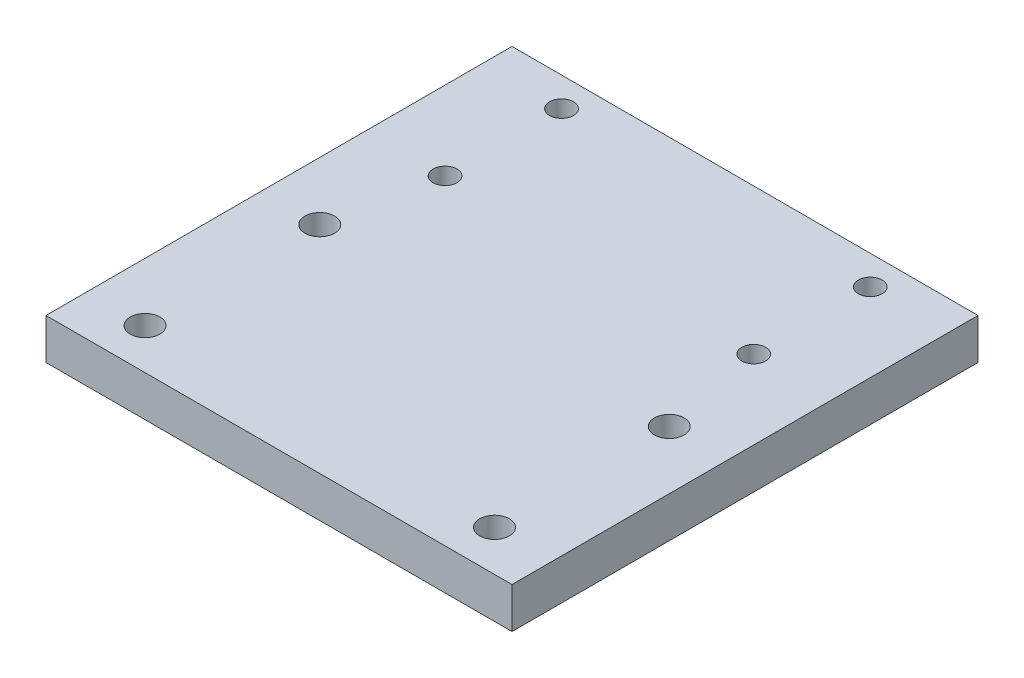
ISO-10303-21;
HEADER;
FILE_DESCRIPTION(('STEP AP214'),'2;1');
FILE_NAME('part.step','',(''),(''),'','','');
FILE_SCHEMA(('AUTOMOTIVE_DESIGN { 1 0 10303 214 1 1 1 1 }'));
ENDSEC;
DATA;
#1=APPLICATION_CONTEXT('core data for automotive mechanical design processes');
#2=APPLICATION_PROTOCOL_DEFINITION('international standard','automotive_design',2000,#1);
#3=PRODUCT_CONTEXT('',#1,'mechanical');
#4=PRODUCT('Part','Part','',(#3));
#5=PRODUCT_RELATED_PRODUCT_CATEGORY('part','',(#4));
#6=PRODUCT_DEFINITION_FORMATION('','',#4);
#7=PRODUCT_DEFINITION_CONTEXT('part definition',#1,'design');
#8=PRODUCT_DEFINITION('design','',#6,#7);
#9=PRODUCT_DEFINITION_SHAPE('','',#8);
#10=(LENGTH_UNIT() NAMED_UNIT(*) SI_UNIT(.MILLI.,.METRE.));
#11=(NAMED_UNIT(*) PLANE_ANGLE_UNIT() SI_UNIT($,.RADIAN.));
#12=(NAMED_UNIT(*) SI_UNIT($,.STERADIAN.) SOLID_ANGLE_UNIT());
#13=UNCERTAINTY_MEASURE_WITH_UNIT(LENGTH_MEASURE(1.E-05),#10,'distance_accuracy_value','');
#14=(GEOMETRIC_REPRESENTATION_CONTEXT(3) GLOBAL_UNCERTAINTY_ASSIGNED_CONTEXT((#13)) GLOBAL_UNIT_ASSIGNED_CONTEXT((#10,
#11,#12)) REPRESENTATION_CONTEXT('',''));
#15=CARTESIAN_POINT('',(0.,0.,0.));
#16=DIRECTION('',(0.,0.,1.));
#17=DIRECTION('',(1.,0.,0.));
#18=AXIS2_PLACEMENT_3D('',#15,#16,#17);
#19=CARTESIAN_POINT('',(0.,0.,0.));
#20=DIRECTION('',(0.,1.,0.));
#21=DIRECTION('',(0.,0.,1.));
#22=AXIS2_PLACEMENT_3D('',#19,#20,#21);
#23=PLANE('',#22);
#24=CARTESIAN_POINT('',(-26.5,0.,-33.));
#25=DIRECTION('',(0.,-1.,0.));
#26=DIRECTION('',(0.,0.,-1.));
#27=AXIS2_PLACEMENT_3D('',#24,#25,#26);
#28=CIRCLE('',#27,2.9765625);
#29=CARTESIAN_POINT('',(-26.5,0.,-35.9765625));
#30=VERTEX_POINT('',#29);
#31=EDGE_CURVE('E360',#30,#30,#28,.T.);
#32=ORIENTED_EDGE('',*,*,#31,.F.);
#33=EDGE_LOOP('',(#32));
#34=FACE_BOUND('',#33,.T.);
#35=CARTESIAN_POINT('',(26.5,0.,-33.));
#36=DIRECTION('',(0.,-1.,0.));
#37=DIRECTION('',(0.,0.,-1.));
#38=AXIS2_PLACEMENT_3D('',#35,#36,#37);
#39=CIRCLE('',#38,2.9765625);
#40=CARTESIAN_POINT('',(26.5,0.,-35.9765625));
#41=VERTEX_POINT('',#40);
#42=EDGE_CURVE('E127',#41,#41,#39,.T.);
#43=ORIENTED_EDGE('',*,*,#42,.F.);
#44=EDGE_LOOP('',(#43));
#45=FACE_BOUND('',#44,.T.);
#46=CARTESIAN_POINT('',(-26.5,0.,-53.));
#47=DIRECTION('',(0.,-1.,0.));
#48=DIRECTION('',(0.,0.,-1.));
#49=AXIS2_PLACEMENT_3D('',#46,#47,#48);
#50=CIRCLE('',#49,2.9765625);
#51=CARTESIAN_POINT('',(-26.5,0.,-55.9765625));
#52=VERTEX_POINT('',#51);
#53=EDGE_CURVE('E120',#52,#52,#50,.T.);
#54=ORIENTED_EDGE('',*,*,#53,.F.);
#55=EDGE_LOOP('',(#54));
#56=FACE_BOUND('',#55,.T.);
#57=CARTESIAN_POINT('',(-30.,0.,15.));
#58=DIRECTION('',(0.,1.,0.));
#59=DIRECTION('',(0.,0.,-1.));
#60=AXIS2_PLACEMENT_3D('',#57,#58,#59);
#61=CIRCLE('',#60,2.55);
#62=CARTESIAN_POINT('',(-30.,0.,12.45));
#63=VERTEX_POINT('',#62);
#64=EDGE_CURVE('E152',#63,#63,#61,.T.);
#65=ORIENTED_EDGE('',*,*,#64,.T.);
#66=EDGE_LOOP('',(#65));
#67=FACE_BOUND('',#66,.T.);
#68=CARTESIAN_POINT('',(30.,0.,15.));
#69=DIRECTION('',(0.,1.,0.));
#70=DIRECTION('',(0.,0.,1.));
#71=AXIS2_PLACEMENT_3D('',#68,#69,#70);
#72=CIRCLE('',#71,2.55);
#73=CARTESIAN_POINT('',(30.,0.,17.55));
#74=VERTEX_POINT('',#73);
#75=EDGE_CURVE('E156',#74,#74,#72,.T.);
#76=ORIENTED_EDGE('',*,*,#75,.T.);
#77=EDGE_LOOP('',(#76));
#78=FACE_BOUND('',#77,.T.);
#79=CARTESIAN_POINT('',(30.,0.,-15.));
#80=DIRECTION('',(0.,1.,0.));
#81=DIRECTION('',(0.,0.,-1.));
#82=AXIS2_PLACEMENT_3D('',#79,#80,#81);
#83=CIRCLE('',#82,2.55);
#84=CARTESIAN_POINT('',(30.,0.,-17.55));
#85=VERTEX_POINT('',#84);
#86=EDGE_CURVE('E162',#85,#85,#83,.T.);
#87=ORIENTED_EDGE('',*,*,#86,.T.);
#88=EDGE_LOOP('',(#87));
#89=FACE_BOUND('',#88,.T.);
#90=CARTESIAN_POINT('',(-30.,0.,-15.));
#91=DIRECTION('',(0.,1.,0.));
#92=DIRECTION('',(0.,0.,1.));
#93=AXIS2_PLACEMENT_3D('',#90,#91,#92);
#94=CIRCLE('',#93,2.55);
#95=CARTESIAN_POINT('',(-30.,0.,-12.45));
#96=VERTEX_POINT('',#95);
#97=EDGE_CURVE('E168',#96,#96,#94,.T.);
#98=ORIENTED_EDGE('',*,*,#97,.T.);
#99=EDGE_LOOP('',(#98));
#100=FACE_BOUND('',#99,.T.);
#101=DIRECTION('',(0.,0.,1.));
#102=VECTOR('',#101,1.);
#103=CARTESIAN_POINT('',(-40.,0.,-58.));
#104=LINE('',#103,#102);
#105=CARTESIAN_POINT('',(-40.,0.,-58.));
#106=VERTEX_POINT('',#105);
#107=CARTESIAN_POINT('',(-40.,0.,22.));
#108=VERTEX_POINT('',#107);
#109=EDGE_CURVE('E100',#106,#108,#104,.T.);
#110=ORIENTED_EDGE('',*,*,#109,.F.);
#111=DIRECTION('',(-1.,0.,0.));
#112=VECTOR('',#111,1.);
#113=CARTESIAN_POINT('',(-40.,0.,-58.));
#114=LINE('',#113,#112);
#115=CARTESIAN_POINT('',(40.,0.,-58.));
#116=VERTEX_POINT('',#115);
#117=EDGE_CURVE('E74',#116,#106,#114,.T.);
#118=ORIENTED_EDGE('',*,*,#117,.F.);
#119=DIRECTION('',(0.,0.,-1.));
#120=VECTOR('',#119,1.);
#121=CARTESIAN_POINT('',(40.,0.,-58.));
#122=LINE('',#121,#120);
#123=CARTESIAN_POINT('',(40.,0.,22.));
#124=VERTEX_POINT('',#123);
#125=EDGE_CURVE('E68',#124,#116,#122,.T.);
#126=ORIENTED_EDGE('',*,*,#125,.F.);
#127=DIRECTION('',(1.,0.,0.));
#128=VECTOR('',#127,1.);
#129=CARTESIAN_POINT('',(-40.,0.,22.));
#130=LINE('',#129,#128);
#131=EDGE_CURVE('E91',#108,#124,#130,.T.);
#132=ORIENTED_EDGE('',*,*,#131,.F.);
#133=EDGE_LOOP('',(#110,#118,#126,#132));
#134=FACE_BOUND('',#133,.T.);
#135=CARTESIAN_POINT('',(26.5,0.,-53.));
#136=DIRECTION('',(0.,-1.,0.));
#137=DIRECTION('',(0.,0.,-1.));
#138=AXIS2_PLACEMENT_3D('',#135,#136,#137);
#139=CIRCLE('',#138,2.9765625);
#140=CARTESIAN_POINT('',(26.5,0.,-55.9765625));
#141=VERTEX_POINT('',#140);
#142=EDGE_CURVE('E116',#141,#141,#139,.T.);
#143=ORIENTED_EDGE('',*,*,#142,.F.);
#144=EDGE_LOOP('',(#143));
#145=FACE_BOUND('',#144,.T.);
#146=ADVANCED_FACE('F32',(#34,#45,#56,#67,#78,#89,#100,#134,#145),#23,.F.);
#147=CARTESIAN_POINT('',(0.,7.,0.));
#148=DIRECTION('',(0.,1.,0.));
#149=DIRECTION('',(0.,0.,1.));
#150=AXIS2_PLACEMENT_3D('',#147,#148,#149);
#151=PLANE('',#150);
#152=CARTESIAN_POINT('',(26.5,7.,-33.));
#153=DIRECTION('',(0.,1.,0.));
#154=DIRECTION('',(0.,0.,1.));
#155=AXIS2_PLACEMENT_3D('',#152,#153,#154);
#156=CIRCLE('',#155,2.05);
#157=CARTESIAN_POINT('',(26.5,7.,-30.95));
#158=VERTEX_POINT('',#157);
#159=EDGE_CURVE('E143',#158,#158,#156,.T.);
#160=ORIENTED_EDGE('',*,*,#159,.F.);
#161=EDGE_LOOP('',(#160));
#162=FACE_BOUND('',#161,.T.);
#163=CARTESIAN_POINT('',(-26.5,7.,-53.));
#164=DIRECTION('',(0.,1.,0.));
#165=DIRECTION('',(0.,0.,1.));
#166=AXIS2_PLACEMENT_3D('',#163,#164,#165);
#167=CIRCLE('',#166,2.05);
#168=CARTESIAN_POINT('',(-26.5,7.,-50.95));
#169=VERTEX_POINT('',#168);
#170=EDGE_CURVE('E149',#169,#169,#167,.T.);
#171=ORIENTED_EDGE('',*,*,#170,.F.);
#172=EDGE_LOOP('',(#171));
#173=FACE_BOUND('',#172,.T.);
#174=CARTESIAN_POINT('',(30.,7.,15.));
#175=DIRECTION('',(0.,1.,0.));
#176=DIRECTION('',(0.,0.,1.));
#177=AXIS2_PLACEMENT_3D('',#174,#175,#176);
#178=CIRCLE('',#177,2.55);
#179=CARTESIAN_POINT('',(30.,7.,17.55));
#180=VERTEX_POINT('',#179);
#181=EDGE_CURVE('E159',#180,#180,#178,.T.);
#182=ORIENTED_EDGE('',*,*,#181,.F.);
#183=EDGE_LOOP('',(#182));
#184=FACE_BOUND('',#183,.T.);
#185=CARTESIAN_POINT('',(-30.,7.,-15.));
#186=DIRECTION('',(0.,1.,0.));
#187=DIRECTION('',(0.,0.,1.));
#188=AXIS2_PLACEMENT_3D('',#185,#186,#187);
#189=CIRCLE('',#188,2.55);
#190=CARTESIAN_POINT('',(-30.,7.,-12.45));
#191=VERTEX_POINT('',#190);
#192=EDGE_CURVE('E103',#191,#191,#189,.T.);
#193=ORIENTED_EDGE('',*,*,#192,.F.);
#194=EDGE_LOOP('',(#193));
#195=FACE_BOUND('',#194,.T.);
#196=DIRECTION('',(0.,0.,1.));
#197=VECTOR('',#196,1.);
#198=CARTESIAN_POINT('',(-40.,7.,-58.));
#199=LINE('',#198,#197);
#200=CARTESIAN_POINT('',(-40.,7.,-58.));
#201=VERTEX_POINT('',#200);
#202=CARTESIAN_POINT('',(-40.,7.,22.));
#203=VERTEX_POINT('',#202);
#204=EDGE_CURVE('E87',#201,#203,#199,.T.);
#205=ORIENTED_EDGE('',*,*,#204,.T.);
#206=DIRECTION('',(1.,0.,0.));
#207=VECTOR('',#206,1.);
#208=CARTESIAN_POINT('',(-40.,7.,22.));
#209=LINE('',#208,#207);
#210=CARTESIAN_POINT('',(40.,7.,22.));
#211=VERTEX_POINT('',#210);
#212=EDGE_CURVE('E81',#203,#211,#209,.T.);
#213=ORIENTED_EDGE('',*,*,#212,.T.);
#214=DIRECTION('',(0.,0.,-1.));
#215=VECTOR('',#214,1.);
#216=CARTESIAN_POINT('',(40.,7.,-58.));
#217=LINE('',#216,#215);
#218=CARTESIAN_POINT('',(40.,7.,-58.));
#219=VERTEX_POINT('',#218);
#220=EDGE_CURVE('E85',#211,#219,#217,.T.);
#221=ORIENTED_EDGE('',*,*,#220,.T.);
#222=DIRECTION('',(-1.,0.,0.));
#223=VECTOR('',#222,1.);
#224=CARTESIAN_POINT('',(-40.,7.,-58.));
#225=LINE('',#224,#223);
#226=EDGE_CURVE('E51',#219,#201,#225,.T.);
#227=ORIENTED_EDGE('',*,*,#226,.T.);
#228=EDGE_LOOP('',(#205,#213,#221,#227));
#229=FACE_BOUND('',#228,.T.);
#230=CARTESIAN_POINT('',(30.,7.,-15.));
#231=DIRECTION('',(0.,1.,0.));
#232=DIRECTION('',(0.,0.,-1.));
#233=AXIS2_PLACEMENT_3D('',#230,#231,#232);
#234=CIRCLE('',#233,2.55);
#235=CARTESIAN_POINT('',(30.,7.,-17.55));
#236=VERTEX_POINT('',#235);
#237=EDGE_CURVE('E165',#236,#236,#234,.T.);
#238=ORIENTED_EDGE('',*,*,#237,.F.);
#239=EDGE_LOOP('',(#238));
#240=FACE_BOUND('',#239,.T.);
#241=CARTESIAN_POINT('',(-30.,7.,15.));
#242=DIRECTION('',(0.,1.,0.));
#243=DIRECTION('',(0.,0.,-1.));
#244=AXIS2_PLACEMENT_3D('',#241,#242,#243);
#245=CIRCLE('',#244,2.55);
#246=CARTESIAN_POINT('',(-30.,7.,12.45));
#247=VERTEX_POINT('',#246);
#248=EDGE_CURVE('E153',#247,#247,#245,.T.);
#249=ORIENTED_EDGE('',*,*,#248,.F.);
#250=EDGE_LOOP('',(#249));
#251=FACE_BOUND('',#250,.T.);
#252=CARTESIAN_POINT('',(26.5,7.,-53.));
#253=DIRECTION('',(0.,1.,0.));
#254=DIRECTION('',(0.,0.,-1.));
#255=AXIS2_PLACEMENT_3D('',#252,#253,#254);
#256=CIRCLE('',#255,2.05);
#257=CARTESIAN_POINT('',(26.5,7.,-55.05));
#258=VERTEX_POINT('',#257);
#259=EDGE_CURVE('E146',#258,#258,#256,.T.);
#260=ORIENTED_EDGE('',*,*,#259,.F.);
#261=EDGE_LOOP('',(#260));
#262=FACE_BOUND('',#261,.T.);
#263=CARTESIAN_POINT('',(-26.5,7.,-33.));
#264=DIRECTION('',(0.,1.,0.));
#265=DIRECTION('',(0.,0.,-1.));
#266=AXIS2_PLACEMENT_3D('',#263,#264,#265);
#267=CIRCLE('',#266,2.05);
#268=CARTESIAN_POINT('',(-26.5,7.,-35.05));
#269=VERTEX_POINT('',#268);
#270=EDGE_CURVE('E112',#269,#269,#267,.T.);
#271=ORIENTED_EDGE('',*,*,#270,.F.);
#272=EDGE_LOOP('',(#271));
#273=FACE_BOUND('',#272,.T.);
#274=ADVANCED_FACE('F82',(#162,#173,#184,#195,#229,#240,#251,#262,#273),#151,.T.);
#275=CARTESIAN_POINT('',(-40.,7.,-58.));
#276=DIRECTION('',(1.,0.,0.));
#277=DIRECTION('',(0.,0.,-1.));
#278=AXIS2_PLACEMENT_3D('',#275,#276,#277);
#279=PLANE('',#278);
#280=ORIENTED_EDGE('',*,*,#109,.T.);
#281=DIRECTION('',(0.,-1.,0.));
#282=VECTOR('',#281,1.);
#283=CARTESIAN_POINT('',(-40.,7.,22.));
#284=LINE('',#283,#282);
#285=EDGE_CURVE('E11',#203,#108,#284,.T.);
#286=ORIENTED_EDGE('',*,*,#285,.F.);
#287=ORIENTED_EDGE('',*,*,#204,.F.);
#288=DIRECTION('',(0.,-1.,0.));
#289=VECTOR('',#288,1.);
#290=CARTESIAN_POINT('',(-40.,7.,-58.));
#291=LINE('',#290,#289);
#292=EDGE_CURVE('E96',#201,#106,#291,.T.);
#293=ORIENTED_EDGE('',*,*,#292,.T.);
#294=EDGE_LOOP('',(#280,#286,#287,#293));
#295=FACE_BOUND('',#294,.T.);
#296=ADVANCED_FACE('F34',(#295),#279,.F.);
#297=CARTESIAN_POINT('',(-40.,7.,22.));
#298=DIRECTION('',(0.,0.,-1.));
#299=DIRECTION('',(-1.,0.,0.));
#300=AXIS2_PLACEMENT_3D('',#297,#298,#299);
#301=PLANE('',#300);
#302=ORIENTED_EDGE('',*,*,#131,.T.);
#303=DIRECTION('',(0.,-1.,0.));
#304=VECTOR('',#303,1.);
#305=CARTESIAN_POINT('',(40.,7.,22.));
#306=LINE('',#305,#304);
#307=EDGE_CURVE('E42',#211,#124,#306,.T.);
#308=ORIENTED_EDGE('',*,*,#307,.F.);
#309=ORIENTED_EDGE('',*,*,#212,.F.);
#310=ORIENTED_EDGE('',*,*,#285,.T.);
#311=EDGE_LOOP('',(#302,#308,#309,#310));
#312=FACE_BOUND('',#311,.T.);
#313=ADVANCED_FACE('F90',(#312),#301,.F.);
#314=CARTESIAN_POINT('',(40.,7.,-58.));
#315=DIRECTION('',(-1.,0.,0.));
#316=DIRECTION('',(0.,0.,1.));
#317=AXIS2_PLACEMENT_3D('',#314,#315,#316);
#318=PLANE('',#317);
#319=ORIENTED_EDGE('',*,*,#125,.T.);
#320=DIRECTION('',(0.,-1.,0.));
#321=VECTOR('',#320,1.);
#322=CARTESIAN_POINT('',(40.,7.,-58.));
#323=LINE('',#322,#321);
#324=EDGE_CURVE('E92',#219,#116,#323,.T.);
#325=ORIENTED_EDGE('',*,*,#324,.F.);
#326=ORIENTED_EDGE('',*,*,#220,.F.);
#327=ORIENTED_EDGE('',*,*,#307,.T.);
#328=EDGE_LOOP('',(#319,#325,#326,#327));
#329=FACE_BOUND('',#328,.T.);
#330=ADVANCED_FACE('F94',(#329),#318,.F.);
#331=CARTESIAN_POINT('',(-40.,7.,-58.));
#332=DIRECTION('',(0.,0.,1.));
#333=DIRECTION('',(1.,0.,0.));
#334=AXIS2_PLACEMENT_3D('',#331,#332,#333);
#335=PLANE('',#334);
#336=ORIENTED_EDGE('',*,*,#117,.T.);
#337=ORIENTED_EDGE('',*,*,#292,.F.);
#338=ORIENTED_EDGE('',*,*,#226,.F.);
#339=ORIENTED_EDGE('',*,*,#324,.T.);
#340=EDGE_LOOP('',(#336,#337,#338,#339));
#341=FACE_BOUND('',#340,.T.);
#342=ADVANCED_FACE('F181',(#341),#335,.F.);
#343=CARTESIAN_POINT('',(-30.,7.,-15.));
#344=DIRECTION('',(0.,-1.,0.));
#345=DIRECTION('',(0.,0.,-1.));
#346=AXIS2_PLACEMENT_3D('',#343,#344,#345);
#347=CYLINDRICAL_SURFACE('',#346,2.55);
#348=ORIENTED_EDGE('',*,*,#192,.T.);
#349=EDGE_LOOP('',(#348));
#350=FACE_BOUND('',#349,.T.);
#351=ORIENTED_EDGE('',*,*,#97,.F.);
#352=EDGE_LOOP('',(#351));
#353=FACE_BOUND('',#352,.T.);
#354=ADVANCED_FACE('F178',(#350,#353),#347,.F.);
#355=CARTESIAN_POINT('',(30.,7.,-15.));
#356=DIRECTION('',(0.,-1.,0.));
#357=DIRECTION('',(0.,0.,-1.));
#358=AXIS2_PLACEMENT_3D('',#355,#356,#357);
#359=CYLINDRICAL_SURFACE('',#358,2.55);
#360=ORIENTED_EDGE('',*,*,#237,.T.);
#361=EDGE_LOOP('',(#360));
#362=FACE_BOUND('',#361,.T.);
#363=ORIENTED_EDGE('',*,*,#86,.F.);
#364=EDGE_LOOP('',(#363));
#365=FACE_BOUND('',#364,.T.);
#366=ADVANCED_FACE('F180',(#362,#365),#359,.F.);
#367=CARTESIAN_POINT('',(30.,7.,15.));
#368=DIRECTION('',(0.,-1.,0.));
#369=DIRECTION('',(0.,0.,-1.));
#370=AXIS2_PLACEMENT_3D('',#367,#368,#369);
#371=CYLINDRICAL_SURFACE('',#370,2.55);
#372=ORIENTED_EDGE('',*,*,#181,.T.);
#373=EDGE_LOOP('',(#372));
#374=FACE_BOUND('',#373,.T.);
#375=ORIENTED_EDGE('',*,*,#75,.F.);
#376=EDGE_LOOP('',(#375));
#377=FACE_BOUND('',#376,.T.);
#378=ADVANCED_FACE('F188',(#374,#377),#371,.F.);
#379=CARTESIAN_POINT('',(-30.,7.,15.));
#380=DIRECTION('',(0.,-1.,0.));
#381=DIRECTION('',(0.,0.,-1.));
#382=AXIS2_PLACEMENT_3D('',#379,#380,#381);
#383=CYLINDRICAL_SURFACE('',#382,2.55);
#384=ORIENTED_EDGE('',*,*,#248,.T.);
#385=EDGE_LOOP('',(#384));
#386=FACE_BOUND('',#385,.T.);
#387=ORIENTED_EDGE('',*,*,#64,.F.);
#388=EDGE_LOOP('',(#387));
#389=FACE_BOUND('',#388,.T.);
#390=ADVANCED_FACE('F248',(#386,#389),#383,.F.);
#391=CARTESIAN_POINT('',(-26.5,7.,-53.));
#392=DIRECTION('',(0.,-1.,0.));
#393=DIRECTION('',(0.,0.,-1.));
#394=AXIS2_PLACEMENT_3D('',#391,#392,#393);
#395=CYLINDRICAL_SURFACE('',#394,2.05);
#396=CARTESIAN_POINT('',(-26.5,2.175,-53.));
#397=DIRECTION('',(0.,1.,0.));
#398=DIRECTION('',(0.,0.,1.));
#399=AXIS2_PLACEMENT_3D('',#396,#397,#398);
#400=CIRCLE('',#399,2.05);
#401=CARTESIAN_POINT('',(-26.5,2.175,-50.95));
#402=VERTEX_POINT('',#401);
#403=EDGE_CURVE('E114',#402,#402,#400,.T.);
#404=ORIENTED_EDGE('',*,*,#403,.F.);
#405=EDGE_LOOP('',(#404));
#406=FACE_BOUND('',#405,.T.);
#407=ORIENTED_EDGE('',*,*,#170,.T.);
#408=EDGE_LOOP('',(#407));
#409=FACE_BOUND('',#408,.T.);
#410=ADVANCED_FACE('F244',(#406,#409),#395,.F.);
#411=CARTESIAN_POINT('',(26.5,7.,-53.));
#412=DIRECTION('',(0.,-1.,0.));
#413=DIRECTION('',(0.,0.,-1.));
#414=AXIS2_PLACEMENT_3D('',#411,#412,#413);
#415=CYLINDRICAL_SURFACE('',#414,2.05);
#416=CARTESIAN_POINT('',(26.5,2.175,-53.));
#417=DIRECTION('',(0.,1.,0.));
#418=DIRECTION('',(0.,0.,1.));
#419=AXIS2_PLACEMENT_3D('',#416,#417,#418);
#420=CIRCLE('',#419,2.05);
#421=CARTESIAN_POINT('',(26.5,2.175,-50.95));
#422=VERTEX_POINT('',#421);
#423=EDGE_CURVE('E109',#422,#422,#420,.T.);
#424=ORIENTED_EDGE('',*,*,#423,.F.);
#425=EDGE_LOOP('',(#424));
#426=FACE_BOUND('',#425,.T.);
#427=ORIENTED_EDGE('',*,*,#259,.T.);
#428=EDGE_LOOP('',(#427));
#429=FACE_BOUND('',#428,.T.);
#430=ADVANCED_FACE('F240',(#426,#429),#415,.F.);
#431=CARTESIAN_POINT('',(26.5,7.,-33.));
#432=DIRECTION('',(0.,-1.,0.));
#433=DIRECTION('',(0.,0.,-1.));
#434=AXIS2_PLACEMENT_3D('',#431,#432,#433);
#435=CYLINDRICAL_SURFACE('',#434,2.05);
#436=CARTESIAN_POINT('',(26.5,2.175,-33.));
#437=DIRECTION('',(0.,1.,0.));
#438=DIRECTION('',(0.,0.,1.));
#439=AXIS2_PLACEMENT_3D('',#436,#437,#438);
#440=CIRCLE('',#439,2.05);
#441=CARTESIAN_POINT('',(26.5,2.175,-30.95));
#442=VERTEX_POINT('',#441);
#443=EDGE_CURVE('E118',#442,#442,#440,.T.);
#444=ORIENTED_EDGE('',*,*,#443,.F.);
#445=EDGE_LOOP('',(#444));
#446=FACE_BOUND('',#445,.T.);
#447=ORIENTED_EDGE('',*,*,#159,.T.);
#448=EDGE_LOOP('',(#447));
#449=FACE_BOUND('',#448,.T.);
#450=ADVANCED_FACE('F236',(#446,#449),#435,.F.);
#451=CARTESIAN_POINT('',(-26.5,7.,-33.));
#452=DIRECTION('',(0.,-1.,0.));
#453=DIRECTION('',(0.,0.,-1.));
#454=AXIS2_PLACEMENT_3D('',#451,#452,#453);
#455=CYLINDRICAL_SURFACE('',#454,2.05);
#456=CARTESIAN_POINT('',(-26.5,2.175,-33.));
#457=DIRECTION('',(0.,1.,0.));
#458=DIRECTION('',(0.,0.,1.));
#459=AXIS2_PLACEMENT_3D('',#456,#457,#458);
#460=CIRCLE('',#459,2.05);
#461=CARTESIAN_POINT('',(-26.5,2.175,-30.95));
#462=VERTEX_POINT('',#461);
#463=EDGE_CURVE('E36',#462,#462,#460,.T.);
#464=ORIENTED_EDGE('',*,*,#463,.F.);
#465=EDGE_LOOP('',(#464));
#466=FACE_BOUND('',#465,.T.);
#467=ORIENTED_EDGE('',*,*,#270,.T.);
#468=EDGE_LOOP('',(#467));
#469=FACE_BOUND('',#468,.T.);
#470=ADVANCED_FACE('F228',(#466,#469),#455,.F.);
#471=CARTESIAN_POINT('',(27.4921875,2.175,-53.));
#472=DIRECTION('',(0.,1.,0.));
#473=DIRECTION('',(0.,0.,1.));
#474=AXIS2_PLACEMENT_3D('',#471,#472,#473);
#475=PLANE('',#474);
#476=ORIENTED_EDGE('',*,*,#423,.T.);
#477=EDGE_LOOP('',(#476));
#478=FACE_BOUND('',#477,.T.);
#479=CARTESIAN_POINT('',(26.5,2.175,-53.));
#480=DIRECTION('',(0.,-1.,0.));
#481=DIRECTION('',(0.,0.,-1.));
#482=AXIS2_PLACEMENT_3D('',#479,#480,#481);
#483=CIRCLE('',#482,2.9765625);
#484=CARTESIAN_POINT('',(26.5,2.175,-55.9765625));
#485=VERTEX_POINT('',#484);
#486=EDGE_CURVE('E113',#485,#485,#483,.T.);
#487=ORIENTED_EDGE('',*,*,#486,.T.);
#488=EDGE_LOOP('',(#487));
#489=FACE_BOUND('',#488,.T.);
#490=ADVANCED_FACE('F218',(#478,#489),#475,.F.);
#491=CARTESIAN_POINT('',(26.5,0.,-53.));
#492=DIRECTION('',(0.,-1.,0.));
#493=DIRECTION('',(0.,0.,-1.));
#494=AXIS2_PLACEMENT_3D('',#491,#492,#493);
#495=CYLINDRICAL_SURFACE('',#494,2.9765625);
#496=ORIENTED_EDGE('',*,*,#486,.F.);
#497=EDGE_LOOP('',(#496));
#498=FACE_BOUND('',#497,.T.);
#499=ORIENTED_EDGE('',*,*,#142,.T.);
#500=EDGE_LOOP('',(#499));
#501=FACE_BOUND('',#500,.T.);
#502=ADVANCED_FACE('F215',(#498,#501),#495,.F.);
#503=CARTESIAN_POINT('',(-25.5078125,2.175,-53.));
#504=DIRECTION('',(0.,1.,0.));
#505=DIRECTION('',(0.,0.,1.));
#506=AXIS2_PLACEMENT_3D('',#503,#504,#505);
#507=PLANE('',#506);
#508=ORIENTED_EDGE('',*,*,#403,.T.);
#509=EDGE_LOOP('',(#508));
#510=FACE_BOUND('',#509,.T.);
#511=CARTESIAN_POINT('',(-26.5,2.175,-53.));
#512=DIRECTION('',(0.,-1.,0.));
#513=DIRECTION('',(0.,0.,-1.));
#514=AXIS2_PLACEMENT_3D('',#511,#512,#513);
#515=CIRCLE('',#514,2.9765625);
#516=CARTESIAN_POINT('',(-26.5,2.175,-55.9765625));
#517=VERTEX_POINT('',#516);
#518=EDGE_CURVE('E117',#517,#517,#515,.T.);
#519=ORIENTED_EDGE('',*,*,#518,.T.);
#520=EDGE_LOOP('',(#519));
#521=FACE_BOUND('',#520,.T.);
#522=ADVANCED_FACE('F217',(#510,#521),#507,.F.);
#523=CARTESIAN_POINT('',(-26.5,0.,-53.));
#524=DIRECTION('',(0.,-1.,0.));
#525=DIRECTION('',(0.,0.,-1.));
#526=AXIS2_PLACEMENT_3D('',#523,#524,#525);
#527=CYLINDRICAL_SURFACE('',#526,2.9765625);
#528=ORIENTED_EDGE('',*,*,#518,.F.);
#529=EDGE_LOOP('',(#528));
#530=FACE_BOUND('',#529,.T.);
#531=ORIENTED_EDGE('',*,*,#53,.T.);
#532=EDGE_LOOP('',(#531));
#533=FACE_BOUND('',#532,.T.);
#534=ADVANCED_FACE('F225',(#530,#533),#527,.F.);
#535=CARTESIAN_POINT('',(27.4921875,2.175,-33.));
#536=DIRECTION('',(0.,1.,0.));
#537=DIRECTION('',(0.,0.,1.));
#538=AXIS2_PLACEMENT_3D('',#535,#536,#537);
#539=PLANE('',#538);
#540=ORIENTED_EDGE('',*,*,#443,.T.);
#541=EDGE_LOOP('',(#540));
#542=FACE_BOUND('',#541,.T.);
#543=CARTESIAN_POINT('',(26.5,2.175,-33.));
#544=DIRECTION('',(0.,-1.,0.));
#545=DIRECTION('',(0.,0.,-1.));
#546=AXIS2_PLACEMENT_3D('',#543,#544,#545);
#547=CIRCLE('',#546,2.9765625);
#548=CARTESIAN_POINT('',(26.5,2.175,-35.9765625));
#549=VERTEX_POINT('',#548);
#550=EDGE_CURVE('E121',#549,#549,#547,.T.);
#551=ORIENTED_EDGE('',*,*,#550,.T.);
#552=EDGE_LOOP('',(#551));
#553=FACE_BOUND('',#552,.T.);
#554=ADVANCED_FACE('F313',(#542,#553),#539,.F.);
#555=CARTESIAN_POINT('',(26.5,0.,-33.));
#556=DIRECTION('',(0.,-1.,0.));
#557=DIRECTION('',(0.,0.,-1.));
#558=AXIS2_PLACEMENT_3D('',#555,#556,#557);
#559=CYLINDRICAL_SURFACE('',#558,2.9765625);
#560=ORIENTED_EDGE('',*,*,#550,.F.);
#561=EDGE_LOOP('',(#560));
#562=FACE_BOUND('',#561,.T.);
#563=ORIENTED_EDGE('',*,*,#42,.T.);
#564=EDGE_LOOP('',(#563));
#565=FACE_BOUND('',#564,.T.);
#566=ADVANCED_FACE('F322',(#562,#565),#559,.F.);
#567=CARTESIAN_POINT('',(-25.5078125,2.175,-33.));
#568=DIRECTION('',(0.,1.,0.));
#569=DIRECTION('',(0.,0.,1.));
#570=AXIS2_PLACEMENT_3D('',#567,#568,#569);
#571=PLANE('',#570);
#572=ORIENTED_EDGE('',*,*,#463,.T.);
#573=EDGE_LOOP('',(#572));
#574=FACE_BOUND('',#573,.T.);
#575=CARTESIAN_POINT('',(-26.5,2.175,-33.));
#576=DIRECTION('',(0.,-1.,0.));
#577=DIRECTION('',(0.,0.,-1.));
#578=AXIS2_PLACEMENT_3D('',#575,#576,#577);
#579=CIRCLE('',#578,2.9765625);
#580=CARTESIAN_POINT('',(-26.5,2.175,-35.9765625));
#581=VERTEX_POINT('',#580);
#582=EDGE_CURVE('E358',#581,#581,#579,.T.);
#583=ORIENTED_EDGE('',*,*,#582,.T.);
#584=EDGE_LOOP('',(#583));
#585=FACE_BOUND('',#584,.T.);
#586=ADVANCED_FACE('F331',(#574,#585),#571,.F.);
#587=CARTESIAN_POINT('',(-26.5,0.,-33.));
#588=DIRECTION('',(0.,-1.,0.));
#589=DIRECTION('',(0.,0.,-1.));
#590=AXIS2_PLACEMENT_3D('',#587,#588,#589);
#591=CYLINDRICAL_SURFACE('',#590,2.9765625);
#592=ORIENTED_EDGE('',*,*,#582,.F.);
#593=EDGE_LOOP('',(#592));
#594=FACE_BOUND('',#593,.T.);
#595=ORIENTED_EDGE('',*,*,#31,.T.);
#596=EDGE_LOOP('',(#595));
#597=FACE_BOUND('',#596,.T.);
#598=ADVANCED_FACE('F341',(#594,#597),#591,.F.);
#599=CLOSED_SHELL('',(#146,#274,#296,#313,#330,#342,#354,#366,#378,#390,#410,#430,#450,#470,
#490,#502,#522,#534,#554,#566,#586,#598));
#600=MANIFOLD_SOLID_BREP('B2',#599);
#601=ADVANCED_BREP_SHAPE_REPRESENTATION('',(#18,#600),#14);
#602=SHAPE_DEFINITION_REPRESENTATION(#9,#601);
ENDSEC;
END-ISO-10303-21;
